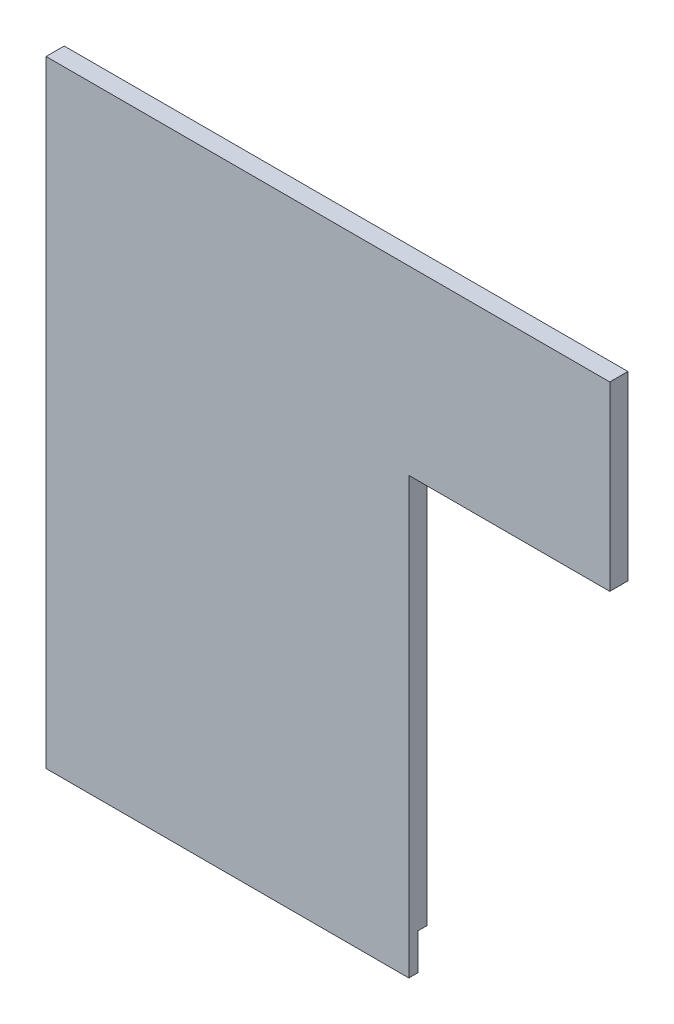
ISO-10303-21;
HEADER;
FILE_DESCRIPTION(('STEP AP214'),'2;1');
FILE_NAME('part.step','',(''),(''),'','','');
FILE_SCHEMA(('AUTOMOTIVE_DESIGN { 1 0 10303 214 1 1 1 1 }'));
ENDSEC;
DATA;
#1=APPLICATION_CONTEXT('core data for automotive mechanical design processes');
#2=APPLICATION_PROTOCOL_DEFINITION('international standard','automotive_design',2000,#1);
#3=PRODUCT_CONTEXT('',#1,'mechanical');
#4=PRODUCT('Part','Part','',(#3));
#5=PRODUCT_RELATED_PRODUCT_CATEGORY('part','',(#4));
#6=PRODUCT_DEFINITION_FORMATION('','',#4);
#7=PRODUCT_DEFINITION_CONTEXT('part definition',#1,'design');
#8=PRODUCT_DEFINITION('design','',#6,#7);
#9=PRODUCT_DEFINITION_SHAPE('','',#8);
#10=(LENGTH_UNIT() NAMED_UNIT(*) SI_UNIT(.MILLI.,.METRE.));
#11=(NAMED_UNIT(*) PLANE_ANGLE_UNIT() SI_UNIT($,.RADIAN.));
#12=(NAMED_UNIT(*) SI_UNIT($,.STERADIAN.) SOLID_ANGLE_UNIT());
#13=UNCERTAINTY_MEASURE_WITH_UNIT(LENGTH_MEASURE(1.E-05),#10,'distance_accuracy_value','');
#14=(GEOMETRIC_REPRESENTATION_CONTEXT(3) GLOBAL_UNCERTAINTY_ASSIGNED_CONTEXT((#13)) GLOBAL_UNIT_ASSIGNED_CONTEXT((#10,
#11,#12)) REPRESENTATION_CONTEXT('',''));
#15=CARTESIAN_POINT('',(0.,0.,0.));
#16=DIRECTION('',(0.,0.,1.));
#17=DIRECTION('',(1.,0.,0.));
#18=AXIS2_PLACEMENT_3D('',#15,#16,#17);
#19=CARTESIAN_POINT('',(0.,0.,3.175));
#20=DIRECTION('',(1.,0.,0.));
#21=DIRECTION('',(0.,0.,-1.));
#22=AXIS2_PLACEMENT_3D('',#19,#20,#21);
#23=PLANE('',#22);
#24=DIRECTION('',(0.,-1.,0.));
#25=VECTOR('',#24,1.);
#26=CARTESIAN_POINT('',(0.,0.,0.));
#27=LINE('',#26,#25);
#28=CARTESIAN_POINT('',(0.,107.95,0.));
#29=VERTEX_POINT('',#28);
#30=CARTESIAN_POINT('',(0.,6.34999999999999,0.));
#31=VERTEX_POINT('',#30);
#32=EDGE_CURVE('E138',#29,#31,#27,.T.);
#33=ORIENTED_EDGE('',*,*,#32,.T.);
#34=DIRECTION('',(0.,0.,-1.));
#35=VECTOR('',#34,1.);
#36=CARTESIAN_POINT('',(0.,6.34999999999999,1.5875));
#37=LINE('',#36,#35);
#38=CARTESIAN_POINT('',(0.,6.34999999999999,1.5875));
#39=VERTEX_POINT('',#38);
#40=EDGE_CURVE('E58',#39,#31,#37,.T.);
#41=ORIENTED_EDGE('',*,*,#40,.F.);
#42=DIRECTION('',(0.,1.,0.));
#43=VECTOR('',#42,1.);
#44=CARTESIAN_POINT('',(0.,0.,1.5875));
#45=LINE('',#44,#43);
#46=CARTESIAN_POINT('',(0.,0.,1.5875));
#47=VERTEX_POINT('',#46);
#48=EDGE_CURVE('E179',#47,#39,#45,.T.);
#49=ORIENTED_EDGE('',*,*,#48,.F.);
#50=DIRECTION('',(0.,0.,-1.));
#51=VECTOR('',#50,1.);
#52=CARTESIAN_POINT('',(0.,0.,3.175));
#53=LINE('',#52,#51);
#54=CARTESIAN_POINT('',(0.,0.,3.175));
#55=VERTEX_POINT('',#54);
#56=EDGE_CURVE('E11',#55,#47,#53,.T.);
#57=ORIENTED_EDGE('',*,*,#56,.F.);
#58=DIRECTION('',(0.,-1.,0.));
#59=VECTOR('',#58,1.);
#60=CARTESIAN_POINT('',(0.,0.,3.175));
#61=LINE('',#60,#59);
#62=CARTESIAN_POINT('',(0.,107.95,3.175));
#63=VERTEX_POINT('',#62);
#64=EDGE_CURVE('E153',#63,#55,#61,.T.);
#65=ORIENTED_EDGE('',*,*,#64,.F.);
#66=DIRECTION('',(0.,0.,-1.));
#67=VECTOR('',#66,1.);
#68=CARTESIAN_POINT('',(0.,107.95,3.175));
#69=LINE('',#68,#67);
#70=EDGE_CURVE('E134',#63,#29,#69,.T.);
#71=ORIENTED_EDGE('',*,*,#70,.T.);
#72=EDGE_LOOP('',(#33,#41,#49,#57,#65,#71));
#73=FACE_BOUND('',#72,.T.);
#74=ADVANCED_FACE('F43',(#73),#23,.F.);
#75=CARTESIAN_POINT('',(0.,0.,3.175));
#76=DIRECTION('',(0.,1.,0.));
#77=DIRECTION('',(0.,0.,1.));
#78=AXIS2_PLACEMENT_3D('',#75,#76,#77);
#79=PLANE('',#78);
#80=ORIENTED_EDGE('',*,*,#56,.T.);
#81=DIRECTION('',(-1.,0.,0.));
#82=VECTOR('',#81,1.);
#83=CARTESIAN_POINT('',(63.5,0.,1.5875));
#84=LINE('',#83,#82);
#85=CARTESIAN_POINT('',(63.5,0.,1.5875));
#86=VERTEX_POINT('',#85);
#87=EDGE_CURVE('E173',#86,#47,#84,.T.);
#88=ORIENTED_EDGE('',*,*,#87,.F.);
#89=DIRECTION('',(0.,0.,-1.));
#90=VECTOR('',#89,1.);
#91=CARTESIAN_POINT('',(63.5,0.,3.175));
#92=LINE('',#91,#90);
#93=CARTESIAN_POINT('',(63.5,0.,3.175));
#94=VERTEX_POINT('',#93);
#95=EDGE_CURVE('E51',#94,#86,#92,.T.);
#96=ORIENTED_EDGE('',*,*,#95,.F.);
#97=DIRECTION('',(1.,0.,0.));
#98=VECTOR('',#97,1.);
#99=CARTESIAN_POINT('',(0.,0.,3.175));
#100=LINE('',#99,#98);
#101=EDGE_CURVE('E95',#55,#94,#100,.T.);
#102=ORIENTED_EDGE('',*,*,#101,.F.);
#103=EDGE_LOOP('',(#80,#88,#96,#102));
#104=FACE_BOUND('',#103,.T.);
#105=ADVANCED_FACE('F171',(#104),#79,.F.);
#106=CARTESIAN_POINT('',(63.5,0.,3.175));
#107=DIRECTION('',(-1.,0.,0.));
#108=DIRECTION('',(0.,0.,1.));
#109=AXIS2_PLACEMENT_3D('',#106,#107,#108);
#110=PLANE('',#109);
#111=DIRECTION('',(0.,-1.,0.));
#112=VECTOR('',#111,1.);
#113=CARTESIAN_POINT('',(63.5,0.,1.5875));
#114=LINE('',#113,#112);
#115=CARTESIAN_POINT('',(63.5,6.35,1.5875));
#116=VERTEX_POINT('',#115);
#117=EDGE_CURVE('E167',#116,#86,#114,.T.);
#118=ORIENTED_EDGE('',*,*,#117,.F.);
#119=DIRECTION('',(0.,0.,-1.));
#120=VECTOR('',#119,1.);
#121=CARTESIAN_POINT('',(63.5,6.35,1.5875));
#122=LINE('',#121,#120);
#123=CARTESIAN_POINT('',(63.5,6.35,0.));
#124=VERTEX_POINT('',#123);
#125=EDGE_CURVE('E143',#116,#124,#122,.T.);
#126=ORIENTED_EDGE('',*,*,#125,.T.);
#127=DIRECTION('',(0.,1.,0.));
#128=VECTOR('',#127,1.);
#129=CARTESIAN_POINT('',(63.5,0.,0.));
#130=LINE('',#129,#128);
#131=CARTESIAN_POINT('',(63.5,76.2,0.));
#132=VERTEX_POINT('',#131);
#133=EDGE_CURVE('E142',#124,#132,#130,.T.);
#134=ORIENTED_EDGE('',*,*,#133,.T.);
#135=DIRECTION('',(0.,0.,-1.));
#136=VECTOR('',#135,1.);
#137=CARTESIAN_POINT('',(63.5,76.2,3.175));
#138=LINE('',#137,#136);
#139=CARTESIAN_POINT('',(63.5,76.2,3.175));
#140=VERTEX_POINT('',#139);
#141=EDGE_CURVE('E127',#140,#132,#138,.T.);
#142=ORIENTED_EDGE('',*,*,#141,.F.);
#143=DIRECTION('',(0.,1.,0.));
#144=VECTOR('',#143,1.);
#145=CARTESIAN_POINT('',(63.5,0.,3.175));
#146=LINE('',#145,#144);
#147=EDGE_CURVE('E112',#94,#140,#146,.T.);
#148=ORIENTED_EDGE('',*,*,#147,.F.);
#149=ORIENTED_EDGE('',*,*,#95,.T.);
#150=EDGE_LOOP('',(#118,#126,#134,#142,#148,#149));
#151=FACE_BOUND('',#150,.T.);
#152=ADVANCED_FACE('F164',(#151),#110,.F.);
#153=CARTESIAN_POINT('',(63.5,76.2,3.175));
#154=DIRECTION('',(0.,1.,0.));
#155=DIRECTION('',(-1.,0.,0.));
#156=AXIS2_PLACEMENT_3D('',#153,#154,#155);
#157=PLANE('',#156);
#158=DIRECTION('',(1.,0.,0.));
#159=VECTOR('',#158,1.);
#160=CARTESIAN_POINT('',(63.5,76.2,0.));
#161=LINE('',#160,#159);
#162=CARTESIAN_POINT('',(98.679,76.2,0.));
#163=VERTEX_POINT('',#162);
#164=EDGE_CURVE('E122',#132,#163,#161,.T.);
#165=ORIENTED_EDGE('',*,*,#164,.T.);
#166=DIRECTION('',(0.,0.,-1.));
#167=VECTOR('',#166,1.);
#168=CARTESIAN_POINT('',(98.679,76.2,3.175));
#169=LINE('',#168,#167);
#170=CARTESIAN_POINT('',(98.679,76.2,3.175));
#171=VERTEX_POINT('',#170);
#172=EDGE_CURVE('E119',#171,#163,#169,.T.);
#173=ORIENTED_EDGE('',*,*,#172,.F.);
#174=DIRECTION('',(1.,0.,0.));
#175=VECTOR('',#174,1.);
#176=CARTESIAN_POINT('',(63.5,76.2,3.175));
#177=LINE('',#176,#175);
#178=EDGE_CURVE('E105',#140,#171,#177,.T.);
#179=ORIENTED_EDGE('',*,*,#178,.F.);
#180=ORIENTED_EDGE('',*,*,#141,.T.);
#181=EDGE_LOOP('',(#165,#173,#179,#180));
#182=FACE_BOUND('',#181,.T.);
#183=ADVANCED_FACE('F120',(#182),#157,.F.);
#184=CARTESIAN_POINT('',(98.679,107.95,3.175));
#185=DIRECTION('',(-1.,0.,0.));
#186=DIRECTION('',(0.,0.,1.));
#187=AXIS2_PLACEMENT_3D('',#184,#185,#186);
#188=PLANE('',#187);
#189=DIRECTION('',(0.,1.,0.));
#190=VECTOR('',#189,1.);
#191=CARTESIAN_POINT('',(98.679,107.95,0.));
#192=LINE('',#191,#190);
#193=CARTESIAN_POINT('',(98.679,107.95,0.));
#194=VERTEX_POINT('',#193);
#195=EDGE_CURVE('E148',#163,#194,#192,.T.);
#196=ORIENTED_EDGE('',*,*,#195,.T.);
#197=DIRECTION('',(0.,0.,-1.));
#198=VECTOR('',#197,1.);
#199=CARTESIAN_POINT('',(98.679,107.95,3.175));
#200=LINE('',#199,#198);
#201=CARTESIAN_POINT('',(98.679,107.95,3.175));
#202=VERTEX_POINT('',#201);
#203=EDGE_CURVE('E128',#202,#194,#200,.T.);
#204=ORIENTED_EDGE('',*,*,#203,.F.);
#205=DIRECTION('',(0.,1.,0.));
#206=VECTOR('',#205,1.);
#207=CARTESIAN_POINT('',(98.679,107.95,3.175));
#208=LINE('',#207,#206);
#209=EDGE_CURVE('E109',#171,#202,#208,.T.);
#210=ORIENTED_EDGE('',*,*,#209,.F.);
#211=ORIENTED_EDGE('',*,*,#172,.T.);
#212=EDGE_LOOP('',(#196,#204,#210,#211));
#213=FACE_BOUND('',#212,.T.);
#214=ADVANCED_FACE('F130',(#213),#188,.F.);
#215=CARTESIAN_POINT('',(0.,107.95,3.175));
#216=DIRECTION('',(0.,-1.,0.));
#217=DIRECTION('',(0.,0.,-1.));
#218=AXIS2_PLACEMENT_3D('',#215,#216,#217);
#219=PLANE('',#218);
#220=DIRECTION('',(-1.,0.,0.));
#221=VECTOR('',#220,1.);
#222=CARTESIAN_POINT('',(0.,107.95,0.));
#223=LINE('',#222,#221);
#224=EDGE_CURVE('E87',#194,#29,#223,.T.);
#225=ORIENTED_EDGE('',*,*,#224,.T.);
#226=ORIENTED_EDGE('',*,*,#70,.F.);
#227=DIRECTION('',(-1.,0.,0.));
#228=VECTOR('',#227,1.);
#229=CARTESIAN_POINT('',(63.5,107.95,3.175));
#230=LINE('',#229,#228);
#231=EDGE_CURVE('E67',#202,#63,#230,.T.);
#232=ORIENTED_EDGE('',*,*,#231,.F.);
#233=ORIENTED_EDGE('',*,*,#203,.T.);
#234=EDGE_LOOP('',(#225,#226,#232,#233));
#235=FACE_BOUND('',#234,.T.);
#236=ADVANCED_FACE('F213',(#235),#219,.F.);
#237=CARTESIAN_POINT('',(0.,0.,3.175));
#238=DIRECTION('',(0.,0.,-1.));
#239=DIRECTION('',(-1.,0.,0.));
#240=AXIS2_PLACEMENT_3D('',#237,#238,#239);
#241=PLANE('',#240);
#242=ORIENTED_EDGE('',*,*,#64,.T.);
#243=ORIENTED_EDGE('',*,*,#101,.T.);
#244=ORIENTED_EDGE('',*,*,#147,.T.);
#245=ORIENTED_EDGE('',*,*,#178,.T.);
#246=ORIENTED_EDGE('',*,*,#209,.T.);
#247=ORIENTED_EDGE('',*,*,#231,.T.);
#248=EDGE_LOOP('',(#242,#243,#244,#245,#246,#247));
#249=FACE_BOUND('',#248,.T.);
#250=ADVANCED_FACE('F107',(#249),#241,.F.);
#251=CARTESIAN_POINT('',(0.,0.,0.));
#252=DIRECTION('',(0.,0.,-1.));
#253=DIRECTION('',(-1.,0.,0.));
#254=AXIS2_PLACEMENT_3D('',#251,#252,#253);
#255=PLANE('',#254);
#256=DIRECTION('',(1.,0.,0.));
#257=VECTOR('',#256,1.);
#258=CARTESIAN_POINT('',(63.5,6.35,0.));
#259=LINE('',#258,#257);
#260=EDGE_CURVE('E185',#31,#124,#259,.T.);
#261=ORIENTED_EDGE('',*,*,#260,.F.);
#262=ORIENTED_EDGE('',*,*,#32,.F.);
#263=ORIENTED_EDGE('',*,*,#224,.F.);
#264=ORIENTED_EDGE('',*,*,#195,.F.);
#265=ORIENTED_EDGE('',*,*,#164,.F.);
#266=ORIENTED_EDGE('',*,*,#133,.F.);
#267=EDGE_LOOP('',(#261,#262,#263,#264,#265,#266));
#268=FACE_BOUND('',#267,.T.);
#269=ADVANCED_FACE('F211',(#268),#255,.T.);
#270=CARTESIAN_POINT('',(63.5,6.35,1.5875));
#271=DIRECTION('',(0.,1.,0.));
#272=DIRECTION('',(-1.,0.,0.));
#273=AXIS2_PLACEMENT_3D('',#270,#271,#272);
#274=PLANE('',#273);
#275=ORIENTED_EDGE('',*,*,#260,.T.);
#276=ORIENTED_EDGE('',*,*,#125,.F.);
#277=DIRECTION('',(1.,0.,0.));
#278=VECTOR('',#277,1.);
#279=CARTESIAN_POINT('',(63.5,6.35,1.5875));
#280=LINE('',#279,#278);
#281=EDGE_CURVE('E183',#39,#116,#280,.T.);
#282=ORIENTED_EDGE('',*,*,#281,.F.);
#283=ORIENTED_EDGE('',*,*,#40,.T.);
#284=EDGE_LOOP('',(#275,#276,#282,#283));
#285=FACE_BOUND('',#284,.T.);
#286=ADVANCED_FACE('F208',(#285),#274,.F.);
#287=CARTESIAN_POINT('',(0.,0.,1.5875));
#288=DIRECTION('',(0.,0.,1.));
#289=DIRECTION('',(1.,0.,0.));
#290=AXIS2_PLACEMENT_3D('',#287,#288,#289);
#291=PLANE('',#290);
#292=ORIENTED_EDGE('',*,*,#117,.T.);
#293=ORIENTED_EDGE('',*,*,#87,.T.);
#294=ORIENTED_EDGE('',*,*,#48,.T.);
#295=ORIENTED_EDGE('',*,*,#281,.T.);
#296=EDGE_LOOP('',(#292,#293,#294,#295));
#297=FACE_BOUND('',#296,.T.);
#298=ADVANCED_FACE('F205',(#297),#291,.F.);
#299=CLOSED_SHELL('',(#74,#105,#152,#183,#214,#236,#250,#269,#286,#298));
#300=MANIFOLD_SOLID_BREP('B2',#299);
#301=ADVANCED_BREP_SHAPE_REPRESENTATION('',(#18,#300),#14);
#302=SHAPE_DEFINITION_REPRESENTATION(#9,#301);
ENDSEC;
END-ISO-10303-21;
